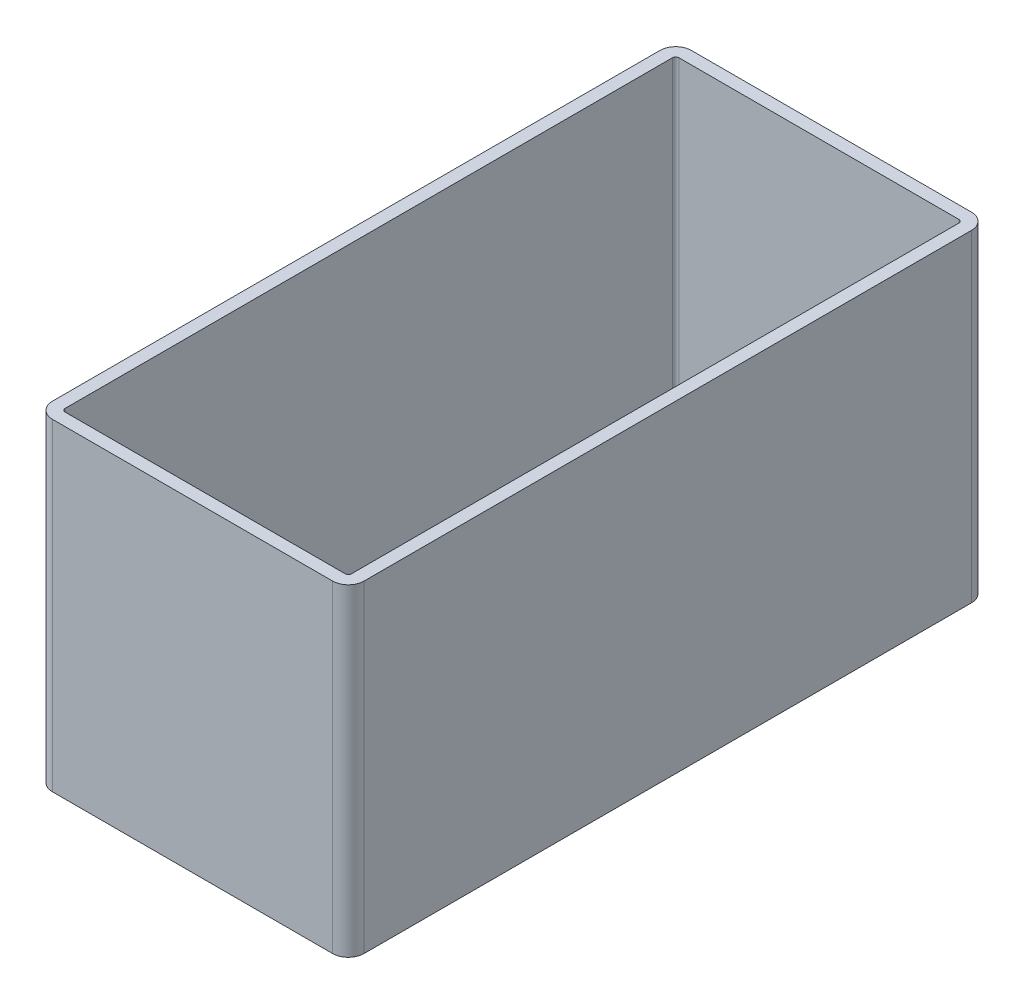
ISO-10303-21;
HEADER;
FILE_DESCRIPTION(('STEP AP214'),'2;1');
FILE_NAME('part.step','',(''),(''),'','','');
FILE_SCHEMA(('AUTOMOTIVE_DESIGN { 1 0 10303 214 1 1 1 1 }'));
ENDSEC;
DATA;
#1=APPLICATION_CONTEXT('core data for automotive mechanical design processes');
#2=APPLICATION_PROTOCOL_DEFINITION('international standard','automotive_design',2000,#1);
#3=PRODUCT_CONTEXT('',#1,'mechanical');
#4=PRODUCT('Part','Part','',(#3));
#5=PRODUCT_RELATED_PRODUCT_CATEGORY('part','',(#4));
#6=PRODUCT_DEFINITION_FORMATION('','',#4);
#7=PRODUCT_DEFINITION_CONTEXT('part definition',#1,'design');
#8=PRODUCT_DEFINITION('design','',#6,#7);
#9=PRODUCT_DEFINITION_SHAPE('','',#8);
#10=(LENGTH_UNIT() NAMED_UNIT(*) SI_UNIT(.MILLI.,.METRE.));
#11=(NAMED_UNIT(*) PLANE_ANGLE_UNIT() SI_UNIT($,.RADIAN.));
#12=(NAMED_UNIT(*) SI_UNIT($,.STERADIAN.) SOLID_ANGLE_UNIT());
#13=UNCERTAINTY_MEASURE_WITH_UNIT(LENGTH_MEASURE(1.E-05),#10,'distance_accuracy_value','');
#14=(GEOMETRIC_REPRESENTATION_CONTEXT(3) GLOBAL_UNCERTAINTY_ASSIGNED_CONTEXT((#13)) GLOBAL_UNIT_ASSIGNED_CONTEXT((#10,
#11,#12)) REPRESENTATION_CONTEXT('',''));
#15=CARTESIAN_POINT('',(0.,0.,0.));
#16=DIRECTION('',(0.,0.,1.));
#17=DIRECTION('',(1.,0.,0.));
#18=AXIS2_PLACEMENT_3D('',#15,#16,#17);
#19=CARTESIAN_POINT('',(9.9,10.25,-20.3));
#20=DIRECTION('',(-1.,0.,0.));
#21=DIRECTION('',(0.,0.,1.));
#22=AXIS2_PLACEMENT_3D('',#19,#20,#21);
#23=PLANE('',#22);
#24=DIRECTION('',(0.,0.,-1.));
#25=VECTOR('',#24,1.);
#26=CARTESIAN_POINT('',(9.9,-10.25,-20.3));
#27=LINE('',#26,#25);
#28=CARTESIAN_POINT('',(9.9,-10.25,19.3));
#29=VERTEX_POINT('',#28);
#30=CARTESIAN_POINT('',(9.9,-10.25,-19.3));
#31=VERTEX_POINT('',#30);
#32=EDGE_CURVE('E204',#29,#31,#27,.T.);
#33=ORIENTED_EDGE('',*,*,#32,.T.);
#34=DIRECTION('',(0.,-1.,0.));
#35=VECTOR('',#34,1.);
#36=CARTESIAN_POINT('',(9.9,10.25,-19.3));
#37=LINE('',#36,#35);
#38=CARTESIAN_POINT('',(9.9,10.25,-19.3));
#39=VERTEX_POINT('',#38);
#40=EDGE_CURVE('E268',#31,#39,#37,.F.);
#41=ORIENTED_EDGE('',*,*,#40,.T.);
#42=DIRECTION('',(0.,0.,-1.));
#43=VECTOR('',#42,1.);
#44=CARTESIAN_POINT('',(9.9,10.25,-20.3));
#45=LINE('',#44,#43);
#46=CARTESIAN_POINT('',(9.9,10.25,19.3));
#47=VERTEX_POINT('',#46);
#48=EDGE_CURVE('E216',#47,#39,#45,.T.);
#49=ORIENTED_EDGE('',*,*,#48,.F.);
#50=DIRECTION('',(0.,-1.,0.));
#51=VECTOR('',#50,1.);
#52=CARTESIAN_POINT('',(9.9,10.25,19.3));
#53=LINE('',#52,#51);
#54=EDGE_CURVE('E265',#47,#29,#53,.T.);
#55=ORIENTED_EDGE('',*,*,#54,.T.);
#56=EDGE_LOOP('',(#33,#41,#49,#55));
#57=FACE_BOUND('',#56,.T.);
#58=ADVANCED_FACE('F35',(#57),#23,.F.);
#59=CARTESIAN_POINT('',(-9.9,10.25,-20.3));
#60=DIRECTION('',(0.,0.,1.));
#61=DIRECTION('',(1.,0.,0.));
#62=AXIS2_PLACEMENT_3D('',#59,#60,#61);
#63=PLANE('',#62);
#64=DIRECTION('',(-1.,0.,0.));
#65=VECTOR('',#64,1.);
#66=CARTESIAN_POINT('',(-9.9,-10.25,-20.3));
#67=LINE('',#66,#65);
#68=CARTESIAN_POINT('',(8.89999999999999,-10.25,-20.3));
#69=VERTEX_POINT('',#68);
#70=CARTESIAN_POINT('',(-8.9,-10.25,-20.3));
#71=VERTEX_POINT('',#70);
#72=EDGE_CURVE('E232',#69,#71,#67,.T.);
#73=ORIENTED_EDGE('',*,*,#72,.T.);
#74=DIRECTION('',(0.,-1.,0.));
#75=VECTOR('',#74,1.);
#76=CARTESIAN_POINT('',(-8.9,10.25,-20.3));
#77=LINE('',#76,#75);
#78=CARTESIAN_POINT('',(-8.9,10.25,-20.3));
#79=VERTEX_POINT('',#78);
#80=EDGE_CURVE('E255',#71,#79,#77,.F.);
#81=ORIENTED_EDGE('',*,*,#80,.T.);
#82=DIRECTION('',(-1.,0.,0.));
#83=VECTOR('',#82,1.);
#84=CARTESIAN_POINT('',(-9.9,10.25,-20.3));
#85=LINE('',#84,#83);
#86=CARTESIAN_POINT('',(8.89999999999999,10.25,-20.3));
#87=VERTEX_POINT('',#86);
#88=EDGE_CURVE('E219',#87,#79,#85,.T.);
#89=ORIENTED_EDGE('',*,*,#88,.F.);
#90=DIRECTION('',(0.,-1.,0.));
#91=VECTOR('',#90,1.);
#92=CARTESIAN_POINT('',(8.9,10.25,-20.3));
#93=LINE('',#92,#91);
#94=EDGE_CURVE('E252',#87,#69,#93,.T.);
#95=ORIENTED_EDGE('',*,*,#94,.T.);
#96=EDGE_LOOP('',(#73,#81,#89,#95));
#97=FACE_BOUND('',#96,.T.);
#98=ADVANCED_FACE('F296',(#97),#63,.F.);
#99=CARTESIAN_POINT('',(-9.9,10.25,-20.3));
#100=DIRECTION('',(1.,0.,0.));
#101=DIRECTION('',(0.,0.,-1.));
#102=AXIS2_PLACEMENT_3D('',#99,#100,#101);
#103=PLANE('',#102);
#104=DIRECTION('',(0.,0.,1.));
#105=VECTOR('',#104,1.);
#106=CARTESIAN_POINT('',(-9.9,10.25,-20.3));
#107=LINE('',#106,#105);
#108=CARTESIAN_POINT('',(-9.9,10.25,-19.3));
#109=VERTEX_POINT('',#108);
#110=CARTESIAN_POINT('',(-9.9,10.25,19.3));
#111=VERTEX_POINT('',#110);
#112=EDGE_CURVE('E223',#109,#111,#107,.T.);
#113=ORIENTED_EDGE('',*,*,#112,.F.);
#114=DIRECTION('',(0.,-1.,0.));
#115=VECTOR('',#114,1.);
#116=CARTESIAN_POINT('',(-9.9,10.25,-19.3));
#117=LINE('',#116,#115);
#118=CARTESIAN_POINT('',(-9.9,-10.25,-19.3));
#119=VERTEX_POINT('',#118);
#120=EDGE_CURVE('E241',#109,#119,#117,.T.);
#121=ORIENTED_EDGE('',*,*,#120,.T.);
#122=DIRECTION('',(0.,0.,1.));
#123=VECTOR('',#122,1.);
#124=CARTESIAN_POINT('',(-9.9,-10.25,-20.3));
#125=LINE('',#124,#123);
#126=CARTESIAN_POINT('',(-9.9,-10.25,19.3));
#127=VERTEX_POINT('',#126);
#128=EDGE_CURVE('E235',#119,#127,#125,.T.);
#129=ORIENTED_EDGE('',*,*,#128,.T.);
#130=DIRECTION('',(0.,-1.,0.));
#131=VECTOR('',#130,1.);
#132=CARTESIAN_POINT('',(-9.9,10.25,19.3));
#133=LINE('',#132,#131);
#134=EDGE_CURVE('E229',#127,#111,#133,.F.);
#135=ORIENTED_EDGE('',*,*,#134,.T.);
#136=EDGE_LOOP('',(#113,#121,#129,#135));
#137=FACE_BOUND('',#136,.T.);
#138=ADVANCED_FACE('F304',(#137),#103,.F.);
#139=CARTESIAN_POINT('',(-9.9,10.25,20.3));
#140=DIRECTION('',(0.,0.,-1.));
#141=DIRECTION('',(-1.,0.,0.));
#142=AXIS2_PLACEMENT_3D('',#139,#140,#141);
#143=PLANE('',#142);
#144=DIRECTION('',(1.,0.,0.));
#145=VECTOR('',#144,1.);
#146=CARTESIAN_POINT('',(-9.9,-10.25,20.3));
#147=LINE('',#146,#145);
#148=CARTESIAN_POINT('',(-8.9,-10.25,20.3));
#149=VERTEX_POINT('',#148);
#150=CARTESIAN_POINT('',(8.9,-10.25,20.3));
#151=VERTEX_POINT('',#150);
#152=EDGE_CURVE('E220',#149,#151,#147,.T.);
#153=ORIENTED_EDGE('',*,*,#152,.T.);
#154=DIRECTION('',(0.,-1.,0.));
#155=VECTOR('',#154,1.);
#156=CARTESIAN_POINT('',(8.9,10.25,20.3));
#157=LINE('',#156,#155);
#158=CARTESIAN_POINT('',(8.9,10.25,20.3));
#159=VERTEX_POINT('',#158);
#160=EDGE_CURVE('E11',#151,#159,#157,.F.);
#161=ORIENTED_EDGE('',*,*,#160,.T.);
#162=DIRECTION('',(1.,0.,0.));
#163=VECTOR('',#162,1.);
#164=CARTESIAN_POINT('',(-9.9,10.25,20.3));
#165=LINE('',#164,#163);
#166=CARTESIAN_POINT('',(-8.9,10.25,20.3));
#167=VERTEX_POINT('',#166);
#168=EDGE_CURVE('E226',#167,#159,#165,.T.);
#169=ORIENTED_EDGE('',*,*,#168,.F.);
#170=DIRECTION('',(0.,-1.,0.));
#171=VECTOR('',#170,1.);
#172=CARTESIAN_POINT('',(-8.9,10.25,20.3));
#173=LINE('',#172,#171);
#174=EDGE_CURVE('E43',#167,#149,#173,.T.);
#175=ORIENTED_EDGE('',*,*,#174,.T.);
#176=EDGE_LOOP('',(#153,#161,#169,#175));
#177=FACE_BOUND('',#176,.T.);
#178=ADVANCED_FACE('F274',(#177),#143,.F.);
#179=CARTESIAN_POINT('',(0.,10.25,0.));
#180=DIRECTION('',(0.,1.,0.));
#181=DIRECTION('',(0.,0.,1.));
#182=AXIS2_PLACEMENT_3D('',#179,#180,#181);
#183=PLANE('',#182);
#184=CARTESIAN_POINT('',(8.9,10.25,-19.3));
#185=DIRECTION('',(0.,1.,0.));
#186=DIRECTION('',(0.,0.,1.));
#187=AXIS2_PLACEMENT_3D('',#184,#185,#186);
#188=CIRCLE('',#187,0.200000000000003);
#189=CARTESIAN_POINT('',(9.1,10.25,-19.3));
#190=VERTEX_POINT('',#189);
#191=CARTESIAN_POINT('',(8.89999999999999,10.25,-19.5));
#192=VERTEX_POINT('',#191);
#193=EDGE_CURVE('E50',#190,#192,#188,.T.);
#194=ORIENTED_EDGE('',*,*,#193,.F.);
#195=DIRECTION('',(0.,0.,-1.));
#196=VECTOR('',#195,1.);
#197=CARTESIAN_POINT('',(9.1,10.25,19.3));
#198=LINE('',#197,#196);
#199=CARTESIAN_POINT('',(9.1,10.25,19.3));
#200=VERTEX_POINT('',#199);
#201=EDGE_CURVE('E166',#200,#190,#198,.T.);
#202=ORIENTED_EDGE('',*,*,#201,.F.);
#203=CARTESIAN_POINT('',(8.9,10.25,19.3));
#204=DIRECTION('',(0.,1.,0.));
#205=DIRECTION('',(0.,0.,1.));
#206=AXIS2_PLACEMENT_3D('',#203,#204,#205);
#207=CIRCLE('',#206,0.200000000000001);
#208=CARTESIAN_POINT('',(8.9,10.25,19.5));
#209=VERTEX_POINT('',#208);
#210=EDGE_CURVE('E169',#209,#200,#207,.T.);
#211=ORIENTED_EDGE('',*,*,#210,.F.);
#212=DIRECTION('',(1.,0.,0.));
#213=VECTOR('',#212,1.);
#214=CARTESIAN_POINT('',(-8.9,10.25,19.5));
#215=LINE('',#214,#213);
#216=CARTESIAN_POINT('',(-8.9,10.25,19.5));
#217=VERTEX_POINT('',#216);
#218=EDGE_CURVE('E197',#217,#209,#215,.T.);
#219=ORIENTED_EDGE('',*,*,#218,.F.);
#220=CARTESIAN_POINT('',(-8.9,10.25,19.3));
#221=DIRECTION('',(0.,1.,0.));
#222=DIRECTION('',(0.,0.,1.));
#223=AXIS2_PLACEMENT_3D('',#220,#221,#222);
#224=CIRCLE('',#223,0.200000000000005);
#225=CARTESIAN_POINT('',(-9.1,10.25,19.3));
#226=VERTEX_POINT('',#225);
#227=EDGE_CURVE('E194',#226,#217,#224,.T.);
#228=ORIENTED_EDGE('',*,*,#227,.F.);
#229=DIRECTION('',(0.,0.,1.));
#230=VECTOR('',#229,1.);
#231=CARTESIAN_POINT('',(-9.1,10.25,-19.3));
#232=LINE('',#231,#230);
#233=CARTESIAN_POINT('',(-9.1,10.25,-19.3));
#234=VERTEX_POINT('',#233);
#235=EDGE_CURVE('E191',#234,#226,#232,.T.);
#236=ORIENTED_EDGE('',*,*,#235,.F.);
#237=CARTESIAN_POINT('',(-8.9,10.25,-19.3));
#238=DIRECTION('',(0.,1.,0.));
#239=DIRECTION('',(0.,0.,1.));
#240=AXIS2_PLACEMENT_3D('',#237,#238,#239);
#241=CIRCLE('',#240,0.200000000000001);
#242=CARTESIAN_POINT('',(-8.9,10.25,-19.5));
#243=VERTEX_POINT('',#242);
#244=EDGE_CURVE('E188',#243,#234,#241,.T.);
#245=ORIENTED_EDGE('',*,*,#244,.F.);
#246=DIRECTION('',(-1.,0.,0.));
#247=VECTOR('',#246,1.);
#248=CARTESIAN_POINT('',(8.89999999999999,10.25,-19.5));
#249=LINE('',#248,#247);
#250=EDGE_CURVE('E186',#192,#243,#249,.T.);
#251=ORIENTED_EDGE('',*,*,#250,.F.);
#252=EDGE_LOOP('',(#194,#202,#211,#219,#228,#236,#245,#251));
#253=FACE_BOUND('',#252,.T.);
#254=ORIENTED_EDGE('',*,*,#88,.T.);
#255=CARTESIAN_POINT('',(-8.9,10.25,-19.3));
#256=DIRECTION('',(0.,1.,0.));
#257=DIRECTION('',(0.,0.,1.));
#258=AXIS2_PLACEMENT_3D('',#255,#256,#257);
#259=CIRCLE('',#258,1.);
#260=EDGE_CURVE('E263',#79,#109,#259,.T.);
#261=ORIENTED_EDGE('',*,*,#260,.T.);
#262=ORIENTED_EDGE('',*,*,#112,.T.);
#263=CARTESIAN_POINT('',(-8.9,10.25,19.3));
#264=DIRECTION('',(0.,1.,0.));
#265=DIRECTION('',(0.,0.,1.));
#266=AXIS2_PLACEMENT_3D('',#263,#264,#265);
#267=CIRCLE('',#266,1.);
#268=EDGE_CURVE('E257',#111,#167,#267,.T.);
#269=ORIENTED_EDGE('',*,*,#268,.T.);
#270=ORIENTED_EDGE('',*,*,#168,.T.);
#271=CARTESIAN_POINT('',(8.9,10.25,19.3));
#272=DIRECTION('',(0.,1.,0.));
#273=DIRECTION('',(0.,0.,1.));
#274=AXIS2_PLACEMENT_3D('',#271,#272,#273);
#275=CIRCLE('',#274,1.);
#276=EDGE_CURVE('E259',#159,#47,#275,.T.);
#277=ORIENTED_EDGE('',*,*,#276,.T.);
#278=ORIENTED_EDGE('',*,*,#48,.T.);
#279=CARTESIAN_POINT('',(8.9,10.25,-19.3));
#280=DIRECTION('',(0.,1.,0.));
#281=DIRECTION('',(0.,0.,1.));
#282=AXIS2_PLACEMENT_3D('',#279,#280,#281);
#283=CIRCLE('',#282,1.);
#284=EDGE_CURVE('E261',#39,#87,#283,.T.);
#285=ORIENTED_EDGE('',*,*,#284,.T.);
#286=EDGE_LOOP('',(#254,#261,#262,#269,#270,#277,#278,#285));
#287=FACE_BOUND('',#286,.T.);
#288=ADVANCED_FACE('F289',(#253,#287),#183,.T.);
#289=CARTESIAN_POINT('',(0.,-10.25,0.));
#290=DIRECTION('',(0.,1.,0.));
#291=DIRECTION('',(0.,0.,1.));
#292=AXIS2_PLACEMENT_3D('',#289,#290,#291);
#293=PLANE('',#292);
#294=DIRECTION('',(0.,0.,-1.));
#295=VECTOR('',#294,1.);
#296=CARTESIAN_POINT('',(9.1,-10.25,19.3));
#297=LINE('',#296,#295);
#298=CARTESIAN_POINT('',(9.1,-10.25,19.3));
#299=VERTEX_POINT('',#298);
#300=CARTESIAN_POINT('',(9.1,-10.25,-19.3));
#301=VERTEX_POINT('',#300);
#302=EDGE_CURVE('E155',#299,#301,#297,.T.);
#303=ORIENTED_EDGE('',*,*,#302,.T.);
#304=CARTESIAN_POINT('',(8.9,-10.25,-19.3));
#305=DIRECTION('',(0.,1.,0.));
#306=DIRECTION('',(0.,0.,1.));
#307=AXIS2_PLACEMENT_3D('',#304,#305,#306);
#308=CIRCLE('',#307,0.200000000000003);
#309=CARTESIAN_POINT('',(8.89999999999999,-10.25,-19.5));
#310=VERTEX_POINT('',#309);
#311=EDGE_CURVE('E149',#301,#310,#308,.T.);
#312=ORIENTED_EDGE('',*,*,#311,.T.);
#313=DIRECTION('',(-1.,0.,0.));
#314=VECTOR('',#313,1.);
#315=CARTESIAN_POINT('',(8.89999999999999,-10.25,-19.5));
#316=LINE('',#315,#314);
#317=CARTESIAN_POINT('',(-8.9,-10.25,-19.5));
#318=VERTEX_POINT('',#317);
#319=EDGE_CURVE('E158',#310,#318,#316,.T.);
#320=ORIENTED_EDGE('',*,*,#319,.T.);
#321=CARTESIAN_POINT('',(-8.9,-10.25,-19.3));
#322=DIRECTION('',(0.,1.,0.));
#323=DIRECTION('',(0.,0.,1.));
#324=AXIS2_PLACEMENT_3D('',#321,#322,#323);
#325=CIRCLE('',#324,0.200000000000001);
#326=CARTESIAN_POINT('',(-9.1,-10.25,-19.3));
#327=VERTEX_POINT('',#326);
#328=EDGE_CURVE('E58',#318,#327,#325,.T.);
#329=ORIENTED_EDGE('',*,*,#328,.T.);
#330=DIRECTION('',(0.,0.,1.));
#331=VECTOR('',#330,1.);
#332=CARTESIAN_POINT('',(-9.1,-10.25,-19.3));
#333=LINE('',#332,#331);
#334=CARTESIAN_POINT('',(-9.1,-10.25,19.3));
#335=VERTEX_POINT('',#334);
#336=EDGE_CURVE('E173',#327,#335,#333,.T.);
#337=ORIENTED_EDGE('',*,*,#336,.T.);
#338=CARTESIAN_POINT('',(-8.9,-10.25,19.3));
#339=DIRECTION('',(0.,1.,0.));
#340=DIRECTION('',(0.,0.,1.));
#341=AXIS2_PLACEMENT_3D('',#338,#339,#340);
#342=CIRCLE('',#341,0.200000000000005);
#343=CARTESIAN_POINT('',(-8.9,-10.25,19.5));
#344=VERTEX_POINT('',#343);
#345=EDGE_CURVE('E176',#335,#344,#342,.T.);
#346=ORIENTED_EDGE('',*,*,#345,.T.);
#347=DIRECTION('',(1.,0.,0.));
#348=VECTOR('',#347,1.);
#349=CARTESIAN_POINT('',(-8.9,-10.25,19.5));
#350=LINE('',#349,#348);
#351=CARTESIAN_POINT('',(8.9,-10.25,19.5));
#352=VERTEX_POINT('',#351);
#353=EDGE_CURVE('E179',#344,#352,#350,.T.);
#354=ORIENTED_EDGE('',*,*,#353,.T.);
#355=CARTESIAN_POINT('',(8.9,-10.25,19.3));
#356=DIRECTION('',(0.,1.,0.));
#357=DIRECTION('',(0.,0.,1.));
#358=AXIS2_PLACEMENT_3D('',#355,#356,#357);
#359=CIRCLE('',#358,0.200000000000001);
#360=EDGE_CURVE('E182',#352,#299,#359,.T.);
#361=ORIENTED_EDGE('',*,*,#360,.T.);
#362=EDGE_LOOP('',(#303,#312,#320,#329,#337,#346,#354,#361));
#363=FACE_BOUND('',#362,.T.);
#364=ORIENTED_EDGE('',*,*,#128,.F.);
#365=CARTESIAN_POINT('',(-8.9,-10.25,-19.3));
#366=DIRECTION('',(0.,1.,0.));
#367=DIRECTION('',(0.,0.,1.));
#368=AXIS2_PLACEMENT_3D('',#365,#366,#367);
#369=CIRCLE('',#368,1.);
#370=EDGE_CURVE('E250',#119,#71,#369,.F.);
#371=ORIENTED_EDGE('',*,*,#370,.T.);
#372=ORIENTED_EDGE('',*,*,#72,.F.);
#373=CARTESIAN_POINT('',(8.9,-10.25,-19.3));
#374=DIRECTION('',(0.,1.,0.));
#375=DIRECTION('',(0.,0.,1.));
#376=AXIS2_PLACEMENT_3D('',#373,#374,#375);
#377=CIRCLE('',#376,1.);
#378=EDGE_CURVE('E248',#69,#31,#377,.F.);
#379=ORIENTED_EDGE('',*,*,#378,.T.);
#380=ORIENTED_EDGE('',*,*,#32,.F.);
#381=CARTESIAN_POINT('',(8.9,-10.25,19.3));
#382=DIRECTION('',(0.,1.,0.));
#383=DIRECTION('',(0.,0.,1.));
#384=AXIS2_PLACEMENT_3D('',#381,#382,#383);
#385=CIRCLE('',#384,1.);
#386=EDGE_CURVE('E246',#29,#151,#385,.F.);
#387=ORIENTED_EDGE('',*,*,#386,.T.);
#388=ORIENTED_EDGE('',*,*,#152,.F.);
#389=CARTESIAN_POINT('',(-8.9,-10.25,19.3));
#390=DIRECTION('',(0.,1.,0.));
#391=DIRECTION('',(0.,0.,1.));
#392=AXIS2_PLACEMENT_3D('',#389,#390,#391);
#393=CIRCLE('',#392,1.);
#394=EDGE_CURVE('E244',#149,#127,#393,.F.);
#395=ORIENTED_EDGE('',*,*,#394,.T.);
#396=EDGE_LOOP('',(#364,#371,#372,#379,#380,#387,#388,#395));
#397=FACE_BOUND('',#396,.T.);
#398=ADVANCED_FACE('F162',(#363,#397),#293,.F.);
#399=CARTESIAN_POINT('',(-8.9,10.25,-19.3));
#400=DIRECTION('',(0.,-1.,0.));
#401=DIRECTION('',(0.,0.,-1.));
#402=AXIS2_PLACEMENT_3D('',#399,#400,#401);
#403=CYLINDRICAL_SURFACE('',#402,1.);
#404=ORIENTED_EDGE('',*,*,#260,.F.);
#405=ORIENTED_EDGE('',*,*,#80,.F.);
#406=ORIENTED_EDGE('',*,*,#370,.F.);
#407=ORIENTED_EDGE('',*,*,#120,.F.);
#408=EDGE_LOOP('',(#404,#405,#406,#407));
#409=FACE_BOUND('',#408,.T.);
#410=ADVANCED_FACE('F301',(#409),#403,.T.);
#411=CARTESIAN_POINT('',(8.9,10.25,-19.3));
#412=DIRECTION('',(0.,-1.,0.));
#413=DIRECTION('',(0.,0.,-1.));
#414=AXIS2_PLACEMENT_3D('',#411,#412,#413);
#415=CYLINDRICAL_SURFACE('',#414,1.);
#416=ORIENTED_EDGE('',*,*,#284,.F.);
#417=ORIENTED_EDGE('',*,*,#40,.F.);
#418=ORIENTED_EDGE('',*,*,#378,.F.);
#419=ORIENTED_EDGE('',*,*,#94,.F.);
#420=EDGE_LOOP('',(#416,#417,#418,#419));
#421=FACE_BOUND('',#420,.T.);
#422=ADVANCED_FACE('F293',(#421),#415,.T.);
#423=CARTESIAN_POINT('',(8.9,10.25,19.3));
#424=DIRECTION('',(0.,-1.,0.));
#425=DIRECTION('',(0.,0.,-1.));
#426=AXIS2_PLACEMENT_3D('',#423,#424,#425);
#427=CYLINDRICAL_SURFACE('',#426,1.);
#428=ORIENTED_EDGE('',*,*,#276,.F.);
#429=ORIENTED_EDGE('',*,*,#160,.F.);
#430=ORIENTED_EDGE('',*,*,#386,.F.);
#431=ORIENTED_EDGE('',*,*,#54,.F.);
#432=EDGE_LOOP('',(#428,#429,#430,#431));
#433=FACE_BOUND('',#432,.T.);
#434=ADVANCED_FACE('F283',(#433),#427,.T.);
#435=CARTESIAN_POINT('',(-8.9,10.25,19.3));
#436=DIRECTION('',(0.,-1.,0.));
#437=DIRECTION('',(0.,0.,-1.));
#438=AXIS2_PLACEMENT_3D('',#435,#436,#437);
#439=CYLINDRICAL_SURFACE('',#438,1.);
#440=ORIENTED_EDGE('',*,*,#268,.F.);
#441=ORIENTED_EDGE('',*,*,#134,.F.);
#442=ORIENTED_EDGE('',*,*,#394,.F.);
#443=ORIENTED_EDGE('',*,*,#174,.F.);
#444=EDGE_LOOP('',(#440,#441,#442,#443));
#445=FACE_BOUND('',#444,.T.);
#446=ADVANCED_FACE('F37',(#445),#439,.T.);
#447=CARTESIAN_POINT('',(8.9,-10.25,-19.3));
#448=DIRECTION('',(0.,1.,0.));
#449=DIRECTION('',(0.,0.,1.));
#450=AXIS2_PLACEMENT_3D('',#447,#448,#449);
#451=CYLINDRICAL_SURFACE('',#450,0.200000000000003);
#452=ORIENTED_EDGE('',*,*,#193,.T.);
#453=DIRECTION('',(0.,1.,0.));
#454=VECTOR('',#453,1.);
#455=CARTESIAN_POINT('',(8.89999999999999,-10.25,-19.5));
#456=LINE('',#455,#454);
#457=EDGE_CURVE('E145',#310,#192,#456,.T.);
#458=ORIENTED_EDGE('',*,*,#457,.F.);
#459=ORIENTED_EDGE('',*,*,#311,.F.);
#460=DIRECTION('',(0.,1.,0.));
#461=VECTOR('',#460,1.);
#462=CARTESIAN_POINT('',(9.1,-10.25,-19.3));
#463=LINE('',#462,#461);
#464=EDGE_CURVE('E202',#301,#190,#463,.T.);
#465=ORIENTED_EDGE('',*,*,#464,.T.);
#466=EDGE_LOOP('',(#452,#458,#459,#465));
#467=FACE_BOUND('',#466,.T.);
#468=ADVANCED_FACE('F147',(#467),#451,.F.);
#469=CARTESIAN_POINT('',(9.1,-10.25,19.3));
#470=DIRECTION('',(1.,0.,0.));
#471=DIRECTION('',(0.,0.,-1.));
#472=AXIS2_PLACEMENT_3D('',#469,#470,#471);
#473=PLANE('',#472);
#474=ORIENTED_EDGE('',*,*,#201,.T.);
#475=ORIENTED_EDGE('',*,*,#464,.F.);
#476=ORIENTED_EDGE('',*,*,#302,.F.);
#477=DIRECTION('',(0.,1.,0.));
#478=VECTOR('',#477,1.);
#479=CARTESIAN_POINT('',(9.1,-10.25,19.3));
#480=LINE('',#479,#478);
#481=EDGE_CURVE('E205',#299,#200,#480,.T.);
#482=ORIENTED_EDGE('',*,*,#481,.T.);
#483=EDGE_LOOP('',(#474,#475,#476,#482));
#484=FACE_BOUND('',#483,.T.);
#485=ADVANCED_FACE('F311',(#484),#473,.F.);
#486=CARTESIAN_POINT('',(8.9,-10.25,19.3));
#487=DIRECTION('',(0.,1.,0.));
#488=DIRECTION('',(0.,0.,1.));
#489=AXIS2_PLACEMENT_3D('',#486,#487,#488);
#490=CYLINDRICAL_SURFACE('',#489,0.200000000000001);
#491=ORIENTED_EDGE('',*,*,#210,.T.);
#492=ORIENTED_EDGE('',*,*,#481,.F.);
#493=ORIENTED_EDGE('',*,*,#360,.F.);
#494=DIRECTION('',(0.,1.,0.));
#495=VECTOR('',#494,1.);
#496=CARTESIAN_POINT('',(8.9,-10.25,19.5));
#497=LINE('',#496,#495);
#498=EDGE_CURVE('E207',#352,#209,#497,.T.);
#499=ORIENTED_EDGE('',*,*,#498,.T.);
#500=EDGE_LOOP('',(#491,#492,#493,#499));
#501=FACE_BOUND('',#500,.T.);
#502=ADVANCED_FACE('F371',(#501),#490,.F.);
#503=CARTESIAN_POINT('',(-8.9,-10.25,19.5));
#504=DIRECTION('',(0.,0.,1.));
#505=DIRECTION('',(1.,0.,0.));
#506=AXIS2_PLACEMENT_3D('',#503,#504,#505);
#507=PLANE('',#506);
#508=ORIENTED_EDGE('',*,*,#218,.T.);
#509=ORIENTED_EDGE('',*,*,#498,.F.);
#510=ORIENTED_EDGE('',*,*,#353,.F.);
#511=DIRECTION('',(0.,1.,0.));
#512=VECTOR('',#511,1.);
#513=CARTESIAN_POINT('',(-8.9,-10.25,19.5));
#514=LINE('',#513,#512);
#515=EDGE_CURVE('E209',#344,#217,#514,.T.);
#516=ORIENTED_EDGE('',*,*,#515,.T.);
#517=EDGE_LOOP('',(#508,#509,#510,#516));
#518=FACE_BOUND('',#517,.T.);
#519=ADVANCED_FACE('F381',(#518),#507,.F.);
#520=CARTESIAN_POINT('',(-8.9,-10.25,19.3));
#521=DIRECTION('',(0.,1.,0.));
#522=DIRECTION('',(0.,0.,1.));
#523=AXIS2_PLACEMENT_3D('',#520,#521,#522);
#524=CYLINDRICAL_SURFACE('',#523,0.200000000000005);
#525=ORIENTED_EDGE('',*,*,#227,.T.);
#526=ORIENTED_EDGE('',*,*,#515,.F.);
#527=ORIENTED_EDGE('',*,*,#345,.F.);
#528=DIRECTION('',(0.,1.,0.));
#529=VECTOR('',#528,1.);
#530=CARTESIAN_POINT('',(-9.1,-10.25,19.3));
#531=LINE('',#530,#529);
#532=EDGE_CURVE('E211',#335,#226,#531,.T.);
#533=ORIENTED_EDGE('',*,*,#532,.T.);
#534=EDGE_LOOP('',(#525,#526,#527,#533));
#535=FACE_BOUND('',#534,.T.);
#536=ADVANCED_FACE('F391',(#535),#524,.F.);
#537=CARTESIAN_POINT('',(-9.1,-10.25,-19.3));
#538=DIRECTION('',(-1.,0.,0.));
#539=DIRECTION('',(0.,0.,1.));
#540=AXIS2_PLACEMENT_3D('',#537,#538,#539);
#541=PLANE('',#540);
#542=ORIENTED_EDGE('',*,*,#235,.T.);
#543=ORIENTED_EDGE('',*,*,#532,.F.);
#544=ORIENTED_EDGE('',*,*,#336,.F.);
#545=DIRECTION('',(0.,1.,0.));
#546=VECTOR('',#545,1.);
#547=CARTESIAN_POINT('',(-9.1,-10.25,-19.3));
#548=LINE('',#547,#546);
#549=EDGE_CURVE('E213',#327,#234,#548,.T.);
#550=ORIENTED_EDGE('',*,*,#549,.T.);
#551=EDGE_LOOP('',(#542,#543,#544,#550));
#552=FACE_BOUND('',#551,.T.);
#553=ADVANCED_FACE('F401',(#552),#541,.F.);
#554=CARTESIAN_POINT('',(-8.9,-10.25,-19.3));
#555=DIRECTION('',(0.,1.,0.));
#556=DIRECTION('',(0.,0.,1.));
#557=AXIS2_PLACEMENT_3D('',#554,#555,#556);
#558=CYLINDRICAL_SURFACE('',#557,0.200000000000001);
#559=ORIENTED_EDGE('',*,*,#244,.T.);
#560=ORIENTED_EDGE('',*,*,#549,.F.);
#561=ORIENTED_EDGE('',*,*,#328,.F.);
#562=DIRECTION('',(0.,1.,0.));
#563=VECTOR('',#562,1.);
#564=CARTESIAN_POINT('',(-8.9,-10.25,-19.5));
#565=LINE('',#564,#563);
#566=EDGE_CURVE('E154',#318,#243,#565,.T.);
#567=ORIENTED_EDGE('',*,*,#566,.T.);
#568=EDGE_LOOP('',(#559,#560,#561,#567));
#569=FACE_BOUND('',#568,.T.);
#570=ADVANCED_FACE('F411',(#569),#558,.F.);
#571=CARTESIAN_POINT('',(8.89999999999999,-10.25,-19.5));
#572=DIRECTION('',(0.,0.,-1.));
#573=DIRECTION('',(-1.,0.,0.));
#574=AXIS2_PLACEMENT_3D('',#571,#572,#573);
#575=PLANE('',#574);
#576=ORIENTED_EDGE('',*,*,#250,.T.);
#577=ORIENTED_EDGE('',*,*,#566,.F.);
#578=ORIENTED_EDGE('',*,*,#319,.F.);
#579=ORIENTED_EDGE('',*,*,#457,.T.);
#580=EDGE_LOOP('',(#576,#577,#578,#579));
#581=FACE_BOUND('',#580,.T.);
#582=ADVANCED_FACE('F159',(#581),#575,.F.);
#583=CLOSED_SHELL('',(#58,#98,#138,#178,#288,#398,#410,#422,#434,#446,#468,#485,#502,#519,#536,
#553,#570,#582));
#584=MANIFOLD_SOLID_BREP('B2',#583);
#585=ADVANCED_BREP_SHAPE_REPRESENTATION('',(#18,#584),#14);
#586=SHAPE_DEFINITION_REPRESENTATION(#9,#585);
ENDSEC;
END-ISO-10303-21;
